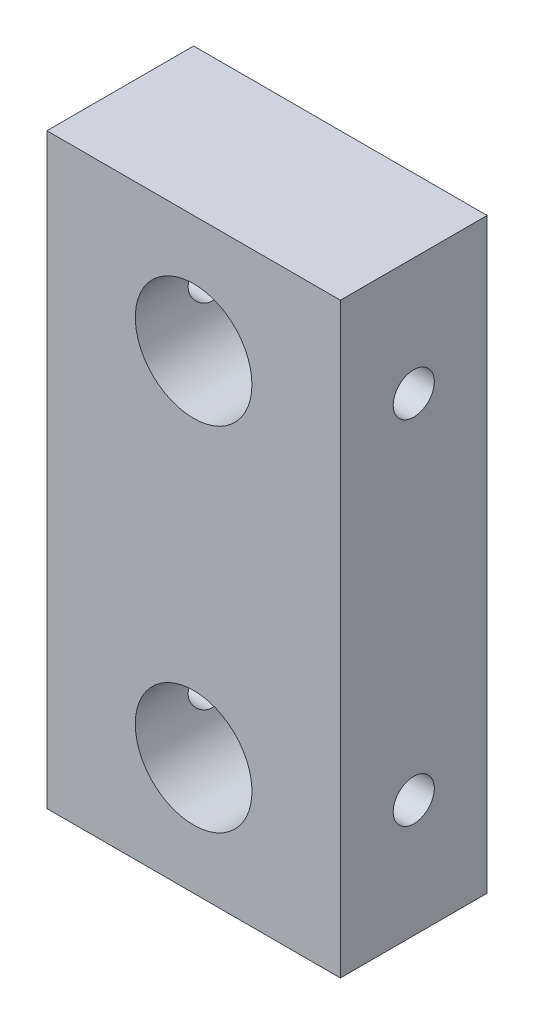
ISO-10303-21;
HEADER;
FILE_DESCRIPTION(('STEP AP214'),'2;1');
FILE_NAME('part.step','',(''),(''),'','','');
FILE_SCHEMA(('AUTOMOTIVE_DESIGN { 1 0 10303 214 1 1 1 1 }'));
ENDSEC;
DATA;
#1=APPLICATION_CONTEXT('core data for automotive mechanical design processes');
#2=APPLICATION_PROTOCOL_DEFINITION('international standard','automotive_design',2000,#1);
#3=PRODUCT_CONTEXT('',#1,'mechanical');
#4=PRODUCT('Part','Part','',(#3));
#5=PRODUCT_RELATED_PRODUCT_CATEGORY('part','',(#4));
#6=PRODUCT_DEFINITION_FORMATION('','',#4);
#7=PRODUCT_DEFINITION_CONTEXT('part definition',#1,'design');
#8=PRODUCT_DEFINITION('design','',#6,#7);
#9=PRODUCT_DEFINITION_SHAPE('','',#8);
#10=(LENGTH_UNIT() NAMED_UNIT(*) SI_UNIT(.MILLI.,.METRE.));
#11=(NAMED_UNIT(*) PLANE_ANGLE_UNIT() SI_UNIT($,.RADIAN.));
#12=(NAMED_UNIT(*) SI_UNIT($,.STERADIAN.) SOLID_ANGLE_UNIT());
#13=UNCERTAINTY_MEASURE_WITH_UNIT(LENGTH_MEASURE(1.E-05),#10,'distance_accuracy_value','');
#14=(GEOMETRIC_REPRESENTATION_CONTEXT(3) GLOBAL_UNCERTAINTY_ASSIGNED_CONTEXT((#13)) GLOBAL_UNIT_ASSIGNED_CONTEXT((#10,
#11,#12)) REPRESENTATION_CONTEXT('',''));
#15=CARTESIAN_POINT('',(0.,0.,0.));
#16=DIRECTION('',(0.,0.,1.));
#17=DIRECTION('',(1.,0.,0.));
#18=AXIS2_PLACEMENT_3D('',#15,#16,#17);
#19=CARTESIAN_POINT('',(0.,0.,10.));
#20=DIRECTION('',(0.,0.,-1.));
#21=DIRECTION('',(-1.,0.,0.));
#22=AXIS2_PLACEMENT_3D('',#19,#20,#21);
#23=PLANE('',#22);
#24=CARTESIAN_POINT('',(0.,12.,10.));
#25=DIRECTION('',(0.,0.,1.));
#26=DIRECTION('',(1.,0.,0.));
#27=AXIS2_PLACEMENT_3D('',#24,#25,#26);
#28=CIRCLE('',#27,3.9740620657712);
#29=CARTESIAN_POINT('',(3.9740620657712,12.,10.));
#30=VERTEX_POINT('',#29);
#31=EDGE_CURVE('E118',#30,#30,#28,.T.);
#32=ORIENTED_EDGE('',*,*,#31,.F.);
#33=EDGE_LOOP('',(#32));
#34=FACE_BOUND('',#33,.T.);
#35=DIRECTION('',(0.,1.,0.));
#36=VECTOR('',#35,1.);
#37=CARTESIAN_POINT('',(10.,-20.,10.));
#38=LINE('',#37,#36);
#39=CARTESIAN_POINT('',(10.,-20.,10.));
#40=VERTEX_POINT('',#39);
#41=CARTESIAN_POINT('',(10.,20.,10.));
#42=VERTEX_POINT('',#41);
#43=EDGE_CURVE('E99',#40,#42,#38,.T.);
#44=ORIENTED_EDGE('',*,*,#43,.T.);
#45=DIRECTION('',(-1.,0.,0.));
#46=VECTOR('',#45,1.);
#47=CARTESIAN_POINT('',(-10.,20.,10.));
#48=LINE('',#47,#46);
#49=CARTESIAN_POINT('',(-10.,20.,10.));
#50=VERTEX_POINT('',#49);
#51=EDGE_CURVE('E94',#42,#50,#48,.T.);
#52=ORIENTED_EDGE('',*,*,#51,.T.);
#53=DIRECTION('',(0.,-1.,0.));
#54=VECTOR('',#53,1.);
#55=CARTESIAN_POINT('',(-10.,-20.,10.));
#56=LINE('',#55,#54);
#57=CARTESIAN_POINT('',(-10.,-20.,10.));
#58=VERTEX_POINT('',#57);
#59=EDGE_CURVE('E97',#50,#58,#56,.T.);
#60=ORIENTED_EDGE('',*,*,#59,.T.);
#61=DIRECTION('',(1.,0.,0.));
#62=VECTOR('',#61,1.);
#63=CARTESIAN_POINT('',(-10.,-20.,10.));
#64=LINE('',#63,#62);
#65=EDGE_CURVE('E63',#58,#40,#64,.T.);
#66=ORIENTED_EDGE('',*,*,#65,.T.);
#67=EDGE_LOOP('',(#44,#52,#60,#66));
#68=FACE_BOUND('',#67,.T.);
#69=CARTESIAN_POINT('',(0.,-12.,10.));
#70=DIRECTION('',(0.,0.,1.));
#71=DIRECTION('',(-1.,0.,0.));
#72=AXIS2_PLACEMENT_3D('',#69,#70,#71);
#73=CIRCLE('',#72,3.9740620657712);
#74=CARTESIAN_POINT('',(-3.9740620657712,-12.,10.));
#75=VERTEX_POINT('',#74);
#76=EDGE_CURVE('E175',#75,#75,#73,.T.);
#77=ORIENTED_EDGE('',*,*,#76,.F.);
#78=EDGE_LOOP('',(#77));
#79=FACE_BOUND('',#78,.T.);
#80=ADVANCED_FACE('F39',(#34,#68,#79),#23,.F.);
#81=CARTESIAN_POINT('',(0.,0.,0.));
#82=DIRECTION('',(0.,0.,-1.));
#83=DIRECTION('',(-1.,0.,0.));
#84=AXIS2_PLACEMENT_3D('',#81,#82,#83);
#85=PLANE('',#84);
#86=CARTESIAN_POINT('',(0.,12.,0.));
#87=DIRECTION('',(0.,0.,1.));
#88=DIRECTION('',(1.,0.,0.));
#89=AXIS2_PLACEMENT_3D('',#86,#87,#88);
#90=CIRCLE('',#89,3.9740620657712);
#91=CARTESIAN_POINT('',(3.9740620657712,12.,0.));
#92=VERTEX_POINT('',#91);
#93=EDGE_CURVE('E178',#92,#92,#90,.T.);
#94=ORIENTED_EDGE('',*,*,#93,.T.);
#95=EDGE_LOOP('',(#94));
#96=FACE_BOUND('',#95,.T.);
#97=DIRECTION('',(0.,1.,0.));
#98=VECTOR('',#97,1.);
#99=CARTESIAN_POINT('',(10.,-20.,0.));
#100=LINE('',#99,#98);
#101=CARTESIAN_POINT('',(10.,-20.,0.));
#102=VERTEX_POINT('',#101);
#103=CARTESIAN_POINT('',(10.,20.,0.));
#104=VERTEX_POINT('',#103);
#105=EDGE_CURVE('E115',#102,#104,#100,.T.);
#106=ORIENTED_EDGE('',*,*,#105,.F.);
#107=DIRECTION('',(1.,0.,0.));
#108=VECTOR('',#107,1.);
#109=CARTESIAN_POINT('',(-10.,-20.,0.));
#110=LINE('',#109,#108);
#111=CARTESIAN_POINT('',(-10.,-20.,0.));
#112=VERTEX_POINT('',#111);
#113=EDGE_CURVE('E86',#112,#102,#110,.T.);
#114=ORIENTED_EDGE('',*,*,#113,.F.);
#115=DIRECTION('',(0.,-1.,0.));
#116=VECTOR('',#115,1.);
#117=CARTESIAN_POINT('',(-10.,-20.,0.));
#118=LINE('',#117,#116);
#119=CARTESIAN_POINT('',(-10.,20.,0.));
#120=VERTEX_POINT('',#119);
#121=EDGE_CURVE('E80',#120,#112,#118,.T.);
#122=ORIENTED_EDGE('',*,*,#121,.F.);
#123=DIRECTION('',(-1.,0.,0.));
#124=VECTOR('',#123,1.);
#125=CARTESIAN_POINT('',(-10.,20.,0.));
#126=LINE('',#125,#124);
#127=EDGE_CURVE('E104',#104,#120,#126,.T.);
#128=ORIENTED_EDGE('',*,*,#127,.F.);
#129=EDGE_LOOP('',(#106,#114,#122,#128));
#130=FACE_BOUND('',#129,.T.);
#131=CARTESIAN_POINT('',(0.,-12.,0.));
#132=DIRECTION('',(0.,0.,1.));
#133=DIRECTION('',(-1.,0.,0.));
#134=AXIS2_PLACEMENT_3D('',#131,#132,#133);
#135=CIRCLE('',#134,3.9740620657712);
#136=CARTESIAN_POINT('',(-3.9740620657712,-12.,0.));
#137=VERTEX_POINT('',#136);
#138=EDGE_CURVE('E174',#137,#137,#135,.T.);
#139=ORIENTED_EDGE('',*,*,#138,.T.);
#140=EDGE_LOOP('',(#139));
#141=FACE_BOUND('',#140,.T.);
#142=ADVANCED_FACE('F200',(#96,#130,#141),#85,.T.);
#143=CARTESIAN_POINT('',(10.,-20.,10.));
#144=DIRECTION('',(-1.,0.,0.));
#145=DIRECTION('',(0.,0.,1.));
#146=AXIS2_PLACEMENT_3D('',#143,#144,#145);
#147=PLANE('',#146);
#148=CARTESIAN_POINT('',(10.,-12.,5.));
#149=DIRECTION('',(-1.,0.,0.));
#150=DIRECTION('',(0.,0.,1.));
#151=AXIS2_PLACEMENT_3D('',#148,#149,#150);
#152=CIRCLE('',#151,1.4);
#153=CARTESIAN_POINT('',(10.,-12.,6.4));
#154=VERTEX_POINT('',#153);
#155=EDGE_CURVE('E160',#154,#154,#152,.T.);
#156=ORIENTED_EDGE('',*,*,#155,.T.);
#157=EDGE_LOOP('',(#156));
#158=FACE_BOUND('',#157,.T.);
#159=CARTESIAN_POINT('',(10.,12.,5.));
#160=DIRECTION('',(-1.,0.,0.));
#161=DIRECTION('',(0.,0.,1.));
#162=AXIS2_PLACEMENT_3D('',#159,#160,#161);
#163=CIRCLE('',#162,1.4);
#164=CARTESIAN_POINT('',(10.,12.,6.4));
#165=VERTEX_POINT('',#164);
#166=EDGE_CURVE('E170',#165,#165,#163,.T.);
#167=ORIENTED_EDGE('',*,*,#166,.T.);
#168=EDGE_LOOP('',(#167));
#169=FACE_BOUND('',#168,.T.);
#170=ORIENTED_EDGE('',*,*,#105,.T.);
#171=DIRECTION('',(0.,0.,-1.));
#172=VECTOR('',#171,1.);
#173=CARTESIAN_POINT('',(10.,20.,10.));
#174=LINE('',#173,#172);
#175=EDGE_CURVE('E11',#42,#104,#174,.T.);
#176=ORIENTED_EDGE('',*,*,#175,.F.);
#177=ORIENTED_EDGE('',*,*,#43,.F.);
#178=DIRECTION('',(0.,0.,-1.));
#179=VECTOR('',#178,1.);
#180=CARTESIAN_POINT('',(10.,-20.,10.));
#181=LINE('',#180,#179);
#182=EDGE_CURVE('E111',#40,#102,#181,.T.);
#183=ORIENTED_EDGE('',*,*,#182,.T.);
#184=EDGE_LOOP('',(#170,#176,#177,#183));
#185=FACE_BOUND('',#184,.T.);
#186=ADVANCED_FACE('F41',(#158,#169,#185),#147,.F.);
#187=CARTESIAN_POINT('',(-10.,20.,10.));
#188=DIRECTION('',(0.,-1.,0.));
#189=DIRECTION('',(0.,0.,-1.));
#190=AXIS2_PLACEMENT_3D('',#187,#188,#189);
#191=PLANE('',#190);
#192=ORIENTED_EDGE('',*,*,#127,.T.);
#193=DIRECTION('',(0.,0.,-1.));
#194=VECTOR('',#193,1.);
#195=CARTESIAN_POINT('',(-10.,20.,10.));
#196=LINE('',#195,#194);
#197=EDGE_CURVE('E54',#50,#120,#196,.T.);
#198=ORIENTED_EDGE('',*,*,#197,.F.);
#199=ORIENTED_EDGE('',*,*,#51,.F.);
#200=ORIENTED_EDGE('',*,*,#175,.T.);
#201=EDGE_LOOP('',(#192,#198,#199,#200));
#202=FACE_BOUND('',#201,.T.);
#203=ADVANCED_FACE('F103',(#202),#191,.F.);
#204=CARTESIAN_POINT('',(-10.,-20.,10.));
#205=DIRECTION('',(1.,0.,0.));
#206=DIRECTION('',(0.,0.,-1.));
#207=AXIS2_PLACEMENT_3D('',#204,#205,#206);
#208=PLANE('',#207);
#209=CARTESIAN_POINT('',(-10.,-12.,5.));
#210=DIRECTION('',(-1.,0.,0.));
#211=DIRECTION('',(0.,0.,-1.));
#212=AXIS2_PLACEMENT_3D('',#209,#210,#211);
#213=CIRCLE('',#212,1.4);
#214=CARTESIAN_POINT('',(-10.,-12.,3.6));
#215=VERTEX_POINT('',#214);
#216=EDGE_CURVE('E156',#215,#215,#213,.T.);
#217=ORIENTED_EDGE('',*,*,#216,.F.);
#218=EDGE_LOOP('',(#217));
#219=FACE_BOUND('',#218,.T.);
#220=CARTESIAN_POINT('',(-10.,12.,5.));
#221=DIRECTION('',(-1.,0.,0.));
#222=DIRECTION('',(0.,0.,1.));
#223=AXIS2_PLACEMENT_3D('',#220,#221,#222);
#224=CIRCLE('',#223,1.4);
#225=CARTESIAN_POINT('',(-10.,12.,6.4));
#226=VERTEX_POINT('',#225);
#227=EDGE_CURVE('E133',#226,#226,#224,.T.);
#228=ORIENTED_EDGE('',*,*,#227,.F.);
#229=EDGE_LOOP('',(#228));
#230=FACE_BOUND('',#229,.T.);
#231=ORIENTED_EDGE('',*,*,#121,.T.);
#232=DIRECTION('',(0.,0.,-1.));
#233=VECTOR('',#232,1.);
#234=CARTESIAN_POINT('',(-10.,-20.,10.));
#235=LINE('',#234,#233);
#236=EDGE_CURVE('E105',#58,#112,#235,.T.);
#237=ORIENTED_EDGE('',*,*,#236,.F.);
#238=ORIENTED_EDGE('',*,*,#59,.F.);
#239=ORIENTED_EDGE('',*,*,#197,.T.);
#240=EDGE_LOOP('',(#231,#237,#238,#239));
#241=FACE_BOUND('',#240,.T.);
#242=ADVANCED_FACE('F107',(#219,#230,#241),#208,.F.);
#243=CARTESIAN_POINT('',(-10.,-20.,10.));
#244=DIRECTION('',(0.,1.,0.));
#245=DIRECTION('',(0.,0.,1.));
#246=AXIS2_PLACEMENT_3D('',#243,#244,#245);
#247=PLANE('',#246);
#248=ORIENTED_EDGE('',*,*,#113,.T.);
#249=ORIENTED_EDGE('',*,*,#182,.F.);
#250=ORIENTED_EDGE('',*,*,#65,.F.);
#251=ORIENTED_EDGE('',*,*,#236,.T.);
#252=EDGE_LOOP('',(#248,#249,#250,#251));
#253=FACE_BOUND('',#252,.T.);
#254=ADVANCED_FACE('F193',(#253),#247,.F.);
#255=CARTESIAN_POINT('',(0.,12.,10.));
#256=DIRECTION('',(0.,0.,-1.));
#257=DIRECTION('',(-1.,0.,0.));
#258=AXIS2_PLACEMENT_3D('',#255,#256,#257);
#259=CYLINDRICAL_SURFACE('',#258,3.9740620657712);
#260=CARTESIAN_POINT('',(-3.9740620657712,12.,6.4));
#261=CARTESIAN_POINT('',(-3.97406299076738,11.9238632491379,6.40000130716296));
#262=CARTESIAN_POINT('',(-3.97185438830035,11.8477358329171,6.39376924705612));
#263=CARTESIAN_POINT('',(-3.96326270757502,11.6977381661153,6.36909269565642));
#264=CARTESIAN_POINT('',(-3.95687966762892,11.623867894825,6.35064831644591));
#265=CARTESIAN_POINT('',(-3.94062900826498,11.4805686406407,6.30226820866657));
#266=CARTESIAN_POINT('',(-3.93076761874704,11.4111319778167,6.2723530166146));
#267=CARTESIAN_POINT('',(-3.90855591190384,11.2782636594435,6.20197844984834));
#268=CARTESIAN_POINT('',(-3.89620501908492,11.2148333973745,6.16151663645677));
#269=CARTESIAN_POINT('',(-3.86977643276472,11.0933587111181,6.06958011130808));
#270=CARTESIAN_POINT('',(-3.85565396136527,11.0355745261973,6.0177745164163));
#271=CARTESIAN_POINT('',(-3.82750844305423,10.9293105677396,5.90532384825463));
#272=CARTESIAN_POINT('',(-3.81348542249417,10.8808331775851,5.84467651767703));
#273=CARTESIAN_POINT('',(-3.78662159123778,10.7929997726817,5.71383339041184));
#274=CARTESIAN_POINT('',(-3.77383461196846,10.7539949081323,5.64338973456764));
#275=CARTESIAN_POINT('',(-3.7515785202712,10.6884995880792,5.4964197240619));
#276=CARTESIAN_POINT('',(-3.74210825916802,10.6620047988662,5.41989548656862));
#277=CARTESIAN_POINT('',(-3.72803250905807,10.6232807808123,5.26591400100132));
#278=CARTESIAN_POINT('',(-3.72325987542372,10.6105596641277,5.18859621481946));
#279=CARTESIAN_POINT('',(-3.71862751810703,10.5982059800021,5.03278755582192));
#280=CARTESIAN_POINT('',(-3.71876605980011,10.5985687913253,4.95429710698089));
#281=CARTESIAN_POINT('',(-3.72379495829744,10.6119933491273,4.80269605304949));
#282=CARTESIAN_POINT('',(-3.72843869096135,10.624396027642,4.72951744337721));
#283=CARTESIAN_POINT('',(-3.74154839545872,10.6604667470507,4.58635548635687));
#284=CARTESIAN_POINT('',(-3.75001487568174,10.6841362863542,4.51637256536899));
#285=CARTESIAN_POINT('',(-3.76997955550244,10.7424688637118,4.38015987668814));
#286=CARTESIAN_POINT('',(-3.78152800762979,10.7773162599723,4.31401674647287));
#287=CARTESIAN_POINT('',(-3.80633626031707,10.8568872442185,4.18831608666073));
#288=CARTESIAN_POINT('',(-3.8195965993597,10.9016139429496,4.12876064024503));
#289=CARTESIAN_POINT('',(-3.84728615581248,11.0027729406603,4.01424595989544));
#290=CARTESIAN_POINT('',(-3.86173827411973,11.0597385967818,3.95976236693862));
#291=CARTESIAN_POINT('',(-3.88950670301774,11.1821719533584,3.86098971545828));
#292=CARTESIAN_POINT('',(-3.90282287755698,11.2476406698596,3.81670187700009));
#293=CARTESIAN_POINT('',(-3.92703119997744,11.3863202051055,3.73913406125834));
#294=CARTESIAN_POINT('',(-3.93789175962928,11.4596158071633,3.70599511734707));
#295=CARTESIAN_POINT('',(-3.95573392315394,11.6112174687782,3.65267014361962));
#296=CARTESIAN_POINT('',(-3.96271703916817,11.6895215617986,3.63247906386566));
#297=CARTESIAN_POINT('',(-3.97176021260367,11.8449011192699,3.60649712577821));
#298=CARTESIAN_POINT('',(-3.97403946552562,11.9218566517211,3.60006457249826));
#299=CARTESIAN_POINT('',(-3.97408431217555,12.0757713903858,3.59993643200145));
#300=CARTESIAN_POINT('',(-3.97185077037708,12.1527305930722,3.6062384053514));
#301=CARTESIAN_POINT('',(-3.96326586836605,12.301809759651,3.63090088984939));
#302=CARTESIAN_POINT('',(-3.957053076077,12.3740055956574,3.64885588228213));
#303=CARTESIAN_POINT('',(-3.94127278584392,12.5143219289863,3.69579589016714));
#304=CARTESIAN_POINT('',(-3.93170485328062,12.5824418969887,3.72478233465678));
#305=CARTESIAN_POINT('',(-3.90984246767208,12.7147922449234,3.79384952566672));
#306=CARTESIAN_POINT('',(-3.89747950386399,12.7788614705039,3.83421675848886));
#307=CARTESIAN_POINT('',(-3.87141474690015,12.8995185029472,3.92456913588847));
#308=CARTESIAN_POINT('',(-3.85771250520531,12.9561037883217,3.97455750816244));
#309=CARTESIAN_POINT('',(-3.8296215744806,13.063198035798,4.08574284438808));
#310=CARTESIAN_POINT('',(-3.81523352842231,13.1132497229725,4.14738153199234));
#311=CARTESIAN_POINT('',(-3.78809334900328,13.2023706271703,4.27848302467864));
#312=CARTESIAN_POINT('',(-3.77534127998417,13.2414394123169,4.34794613728726));
#313=CARTESIAN_POINT('',(-3.75301572830405,13.3073873709782,4.49296714148634));
#314=CARTESIAN_POINT('',(-3.74344333915057,13.3342623521441,4.56852711873791));
#315=CARTESIAN_POINT('',(-3.72876316632749,13.3747609294465,4.72352311796735));
#316=CARTESIAN_POINT('',(-3.72365305152176,13.3883914450426,4.80295709320179));
#317=CARTESIAN_POINT('',(-3.71876132237575,13.4014375654857,4.95855834621949));
#318=CARTESIAN_POINT('',(-3.71869183082166,13.4016211500576,5.03465282115501));
#319=CARTESIAN_POINT('',(-3.72316574992853,13.389692690837,5.18572649227421));
#320=CARTESIAN_POINT('',(-3.72770882059773,13.377581553288,5.26070577024569));
#321=CARTESIAN_POINT('',(-3.74066994504375,13.3419765664647,5.4056324749777));
#322=CARTESIAN_POINT('',(-3.74899347105649,13.318759696096,5.47565709158563));
#323=CARTESIAN_POINT('',(-3.76853340213479,13.2618346002039,5.61086629950798));
#324=CARTESIAN_POINT('',(-3.77975049284722,13.2281238877118,5.67604973895626));
#325=CARTESIAN_POINT('',(-3.80448019602381,13.1492959944011,5.80310097774087));
#326=CARTESIAN_POINT('',(-3.81807678547265,13.1037114084334,5.86466228856341));
#327=CARTESIAN_POINT('',(-3.84571105275315,13.0031899132098,5.97950875085334));
#328=CARTESIAN_POINT('',(-3.85974886111676,12.9482502146555,6.03279142489387));
#329=CARTESIAN_POINT('',(-3.88744983588713,12.8275866260141,6.13202156436028));
#330=CARTESIAN_POINT('',(-3.90106700324151,12.7614861759869,6.17752577289977));
#331=CARTESIAN_POINT('',(-3.92570352574442,12.6221106941998,6.25674202286226));
#332=CARTESIAN_POINT('',(-3.93672317842965,12.5488364855326,6.29045541509847));
#333=CARTESIAN_POINT('',(-3.95485017508797,12.3976028977471,6.34473959970089));
#334=CARTESIAN_POINT('',(-3.96198087224606,12.3196746743459,6.36538896419913));
#335=CARTESIAN_POINT('',(-3.97158548072441,12.1611601635844,6.39301598477926));
#336=CARTESIAN_POINT('',(-3.97406108685586,12.080574854485,6.39999861664092));
#337=CARTESIAN_POINT('',(-3.9740620657712,12.,6.4));
#338=B_SPLINE_CURVE_WITH_KNOTS('',3,(#260,#261,#262,#263,#264,#265,#266,#267,#268,#269,#270,
#271,#272,#273,#274,#275,#276,#277,#278,#279,#280,#281,#282,#283,#284,#285,#286,#287,#288,#289,
#290,#291,#292,#293,#294,#295,#296,#297,#298,#299,#300,#301,#302,#303,#304,#305,#306,#307,#308,
#309,#310,#311,#312,#313,#314,#315,#316,#317,#318,#319,#320,#321,#322,#323,#324,#325,#326,#327,
#328,#329,#330,#331,#332,#333,#334,#335,#336,#337),.UNSPECIFIED.,.T.,.F.,(4,2,2,2,2,2,2,2,2,2,2,
2,2,2,2,2,2,2,2,2,2,2,2,2,2,2,2,2,2,2,2,2,2,2,2,2,2,2,4),(0.,0.228113425178087,
0.456224756803591,0.683929586896564,0.911687115568946,1.14727729809536,1.38292773280091,
1.62630396091785,1.86959581727646,2.10387928111179,2.33807999697389,2.5601437903135,
2.78223712475768,3.00820007054267,3.23423426809542,3.47354903039417,3.71289241519983,
3.95515867321822,4.19733038476894,4.42793604179114,4.65849752804989,4.88143710200168,
5.10440556584771,5.33358352568652,5.56283850450462,5.80378943643102,6.04474984185729,
6.28579302916251,6.52671021766525,6.75385677113896,6.9809865828658,7.202725707259,
7.42451742236152,7.65688909666168,7.88933017606088,8.13233199006419,8.37530595547244,
8.61680433010967,8.85821476372663),.UNSPECIFIED.);
#339=CARTESIAN_POINT('',(-3.9740620657712,12.,6.4));
#340=VERTEX_POINT('',#339);
#341=EDGE_CURVE('E132',#340,#340,#338,.T.);
#342=ORIENTED_EDGE('',*,*,#341,.F.);
#343=EDGE_LOOP('',(#342));
#344=FACE_BOUND('',#343,.T.);
#345=CARTESIAN_POINT('',(3.9740620657712,12.,6.4));
#346=CARTESIAN_POINT('',(3.97406299076738,12.0761367508621,6.40000130716296));
#347=CARTESIAN_POINT('',(3.97185438830035,12.1522641670829,6.39376924705612));
#348=CARTESIAN_POINT('',(3.96326270757502,12.3022618338847,6.36909269565642));
#349=CARTESIAN_POINT('',(3.95687966762892,12.376132105175,6.35064831644591));
#350=CARTESIAN_POINT('',(3.94062900826498,12.5194313593593,6.30226820866657));
#351=CARTESIAN_POINT('',(3.93076761874704,12.5888680221833,6.2723530166146));
#352=CARTESIAN_POINT('',(3.90855591190384,12.7217363405565,6.20197844984834));
#353=CARTESIAN_POINT('',(3.89620501908492,12.7851666026255,6.16151663645677));
#354=CARTESIAN_POINT('',(3.86977643276472,12.9066412888819,6.06958011130809));
#355=CARTESIAN_POINT('',(3.85565396136527,12.9644254738027,6.0177745164163));
#356=CARTESIAN_POINT('',(3.82750844305423,13.0706894322604,5.90532384825463));
#357=CARTESIAN_POINT('',(3.81348542249417,13.1191668224149,5.84467651767704));
#358=CARTESIAN_POINT('',(3.78662159123778,13.2070002273183,5.71383339041185));
#359=CARTESIAN_POINT('',(3.77383461196846,13.2460050918677,5.64338973456764));
#360=CARTESIAN_POINT('',(3.7515785202712,13.3115004119208,5.4964197240619));
#361=CARTESIAN_POINT('',(3.74210825916802,13.3379952011338,5.41989548656863));
#362=CARTESIAN_POINT('',(3.72803250905807,13.3767192191877,5.26591400100133));
#363=CARTESIAN_POINT('',(3.72325987542372,13.3894403358723,5.18859621481947));
#364=CARTESIAN_POINT('',(3.71862751810703,13.4017940199979,5.03278755582192));
#365=CARTESIAN_POINT('',(3.71876605980011,13.4014312086748,4.95429710698089));
#366=CARTESIAN_POINT('',(3.72379495829744,13.3880066508727,4.80269605304949));
#367=CARTESIAN_POINT('',(3.72843869096135,13.375603972358,4.72951744337721));
#368=CARTESIAN_POINT('',(3.74154839545872,13.3395332529493,4.58635548635688));
#369=CARTESIAN_POINT('',(3.75001487568174,13.3158637136458,4.516372565369));
#370=CARTESIAN_POINT('',(3.76997955550244,13.2575311362882,4.38015987668814));
#371=CARTESIAN_POINT('',(3.78152800762979,13.2226837400277,4.31401674647287));
#372=CARTESIAN_POINT('',(3.80633626031707,13.1431127557815,4.18831608666073));
#373=CARTESIAN_POINT('',(3.8195965993597,13.0983860570504,4.12876064024503));
#374=CARTESIAN_POINT('',(3.84728615581248,12.9972270593397,4.01424595989544));
#375=CARTESIAN_POINT('',(3.86173827411973,12.9402614032182,3.95976236693862));
#376=CARTESIAN_POINT('',(3.88950670301774,12.8178280466416,3.86098971545828));
#377=CARTESIAN_POINT('',(3.90282287755698,12.7523593301405,3.81670187700009));
#378=CARTESIAN_POINT('',(3.92703119997744,12.6136797948945,3.73913406125834));
#379=CARTESIAN_POINT('',(3.93789175962928,12.5403841928367,3.70599511734707));
#380=CARTESIAN_POINT('',(3.95573392315394,12.3887825312218,3.65267014361962));
#381=CARTESIAN_POINT('',(3.96271703916817,12.3104784382014,3.63247906386566));
#382=CARTESIAN_POINT('',(3.97176021260368,12.1550988807301,3.60649712577821));
#383=CARTESIAN_POINT('',(3.97403946552562,12.0781433482789,3.60006457249826));
#384=CARTESIAN_POINT('',(3.97408431217555,11.9242286096142,3.59993643200145));
#385=CARTESIAN_POINT('',(3.97185077037708,11.8472694069278,3.6062384053514));
#386=CARTESIAN_POINT('',(3.96326586836605,11.698190240349,3.63090088984938));
#387=CARTESIAN_POINT('',(3.957053076077,11.6259944043426,3.64885588228212));
#388=CARTESIAN_POINT('',(3.94127278584392,11.4856780710137,3.69579589016714));
#389=CARTESIAN_POINT('',(3.93170485328062,11.4175581030113,3.72478233465678));
#390=CARTESIAN_POINT('',(3.90984246767208,11.2852077550766,3.79384952566672));
#391=CARTESIAN_POINT('',(3.89747950386399,11.2211385294961,3.83421675848886));
#392=CARTESIAN_POINT('',(3.87141474690015,11.1004814970528,3.92456913588846));
#393=CARTESIAN_POINT('',(3.85771250520531,11.0438962116783,3.97455750816244));
#394=CARTESIAN_POINT('',(3.82962157448061,10.936801964202,4.08574284438808));
#395=CARTESIAN_POINT('',(3.81523352842231,10.8867502770275,4.14738153199234));
#396=CARTESIAN_POINT('',(3.78809334900328,10.7976293728297,4.27848302467864));
#397=CARTESIAN_POINT('',(3.77534127998417,10.7585605876831,4.34794613728726));
#398=CARTESIAN_POINT('',(3.75301572830406,10.6926126290218,4.49296714148634));
#399=CARTESIAN_POINT('',(3.74344333915057,10.6657376478559,4.5685271187379));
#400=CARTESIAN_POINT('',(3.72876316632749,10.6252390705535,4.72352311796735));
#401=CARTESIAN_POINT('',(3.72365305152176,10.6116085549574,4.80295709320179));
#402=CARTESIAN_POINT('',(3.71876132237576,10.5985624345143,4.95855834621949));
#403=CARTESIAN_POINT('',(3.71869183082167,10.5983788499424,5.03465282115501));
#404=CARTESIAN_POINT('',(3.72316574992854,10.610307309163,5.1857264922742));
#405=CARTESIAN_POINT('',(3.72770882059774,10.622418446712,5.26070577024569));
#406=CARTESIAN_POINT('',(3.74066994504375,10.6580234335353,5.4056324749777));
#407=CARTESIAN_POINT('',(3.7489934710565,10.681240303904,5.47565709158562));
#408=CARTESIAN_POINT('',(3.76853340213479,10.7381653997961,5.61086629950797));
#409=CARTESIAN_POINT('',(3.77975049284723,10.7718761122882,5.67604973895626));
#410=CARTESIAN_POINT('',(3.80448019602381,10.8507040055989,5.80310097774087));
#411=CARTESIAN_POINT('',(3.81807678547265,10.8962885915666,5.86466228856341));
#412=CARTESIAN_POINT('',(3.84571105275315,10.9968100867902,5.97950875085334));
#413=CARTESIAN_POINT('',(3.85974886111676,11.0517497853445,6.03279142489387));
#414=CARTESIAN_POINT('',(3.88744983588713,11.1724133739859,6.13202156436028));
#415=CARTESIAN_POINT('',(3.90106700324151,11.2385138240131,6.17752577289977));
#416=CARTESIAN_POINT('',(3.92570352574442,11.3778893058002,6.25674202286226));
#417=CARTESIAN_POINT('',(3.93672317842965,11.4511635144674,6.29045541509846));
#418=CARTESIAN_POINT('',(3.95485017508797,11.6023971022529,6.34473959970089));
#419=CARTESIAN_POINT('',(3.96198087224606,11.6803253256541,6.36538896419913));
#420=CARTESIAN_POINT('',(3.97158548072441,11.8388398364156,6.39301598477926));
#421=CARTESIAN_POINT('',(3.97406108685586,11.919425145515,6.39999861664092));
#422=CARTESIAN_POINT('',(3.9740620657712,12.,6.4));
#423=B_SPLINE_CURVE_WITH_KNOTS('',3,(#345,#346,#347,#348,#349,#350,#351,#352,#353,#354,#355,
#356,#357,#358,#359,#360,#361,#362,#363,#364,#365,#366,#367,#368,#369,#370,#371,#372,#373,#374,
#375,#376,#377,#378,#379,#380,#381,#382,#383,#384,#385,#386,#387,#388,#389,#390,#391,#392,#393,
#394,#395,#396,#397,#398,#399,#400,#401,#402,#403,#404,#405,#406,#407,#408,#409,#410,#411,#412,
#413,#414,#415,#416,#417,#418,#419,#420,#421,#422),.UNSPECIFIED.,.T.,.F.,(4,2,2,2,2,2,2,2,2,2,2,
2,2,2,2,2,2,2,2,2,2,2,2,2,2,2,2,2,2,2,2,2,2,2,2,2,2,2,4),(0.,0.228113425178085,0.45622475680359,
0.683929586896563,0.911687115568946,1.14727729809536,1.38292773280091,1.62630396091784,
1.86959581727646,2.10387928111179,2.33807999697389,2.56014379031349,2.78223712475768,
3.00820007054267,3.23423426809541,3.47354903039417,3.71289241519983,3.95515867321822,
4.19733038476893,4.42793604179114,4.65849752804989,4.88143710200167,5.1044055658477,
5.33358352568652,5.56283850450462,5.80378943643102,6.04474984185729,6.28579302916251,
6.52671021766525,6.75385677113896,6.9809865828658,7.202725707259,7.42451742236152,
7.65688909666168,7.88933017606088,8.13233199006419,8.37530595547244,8.61680433010967,
8.85821476372663),.UNSPECIFIED.);
#424=CARTESIAN_POINT('',(3.9740620657712,12.,6.4));
#425=VERTEX_POINT('',#424);
#426=EDGE_CURVE('E124',#425,#425,#423,.T.);
#427=ORIENTED_EDGE('',*,*,#426,.F.);
#428=EDGE_LOOP('',(#427));
#429=FACE_BOUND('',#428,.T.);
#430=ORIENTED_EDGE('',*,*,#31,.T.);
#431=EDGE_LOOP('',(#430));
#432=FACE_BOUND('',#431,.T.);
#433=ORIENTED_EDGE('',*,*,#93,.F.);
#434=EDGE_LOOP('',(#433));
#435=FACE_BOUND('',#434,.T.);
#436=ADVANCED_FACE('F136',(#344,#429,#432,#435),#259,.F.);
#437=CARTESIAN_POINT('',(0.,-12.,10.));
#438=DIRECTION('',(0.,0.,-1.));
#439=DIRECTION('',(-1.,0.,0.));
#440=AXIS2_PLACEMENT_3D('',#437,#438,#439);
#441=CYLINDRICAL_SURFACE('',#440,3.9740620657712);
#442=CARTESIAN_POINT('',(-3.9740620657712,-12.,6.4));
#443=CARTESIAN_POINT('',(-3.97406299076738,-12.0761367508621,6.40000130716296));
#444=CARTESIAN_POINT('',(-3.97185438830035,-12.1522641670829,6.39376924705612));
#445=CARTESIAN_POINT('',(-3.96326270757502,-12.3022618338847,6.36909269565642));
#446=CARTESIAN_POINT('',(-3.95687966762892,-12.376132105175,6.35064831644591));
#447=CARTESIAN_POINT('',(-3.94062900826498,-12.5194313593593,6.30226820866657));
#448=CARTESIAN_POINT('',(-3.93076761874704,-12.5888680221833,6.2723530166146));
#449=CARTESIAN_POINT('',(-3.90855591190384,-12.7217363405565,6.20197844984834));
#450=CARTESIAN_POINT('',(-3.89620501908492,-12.7851666026255,6.16151663645677));
#451=CARTESIAN_POINT('',(-3.86977643276472,-12.9066412888819,6.06958011130809));
#452=CARTESIAN_POINT('',(-3.85565396136527,-12.9644254738027,6.0177745164163));
#453=CARTESIAN_POINT('',(-3.82750844305423,-13.0706894322604,5.90532384825463));
#454=CARTESIAN_POINT('',(-3.81348542249417,-13.1191668224149,5.84467651767704));
#455=CARTESIAN_POINT('',(-3.78662159123778,-13.2070002273183,5.71383339041185));
#456=CARTESIAN_POINT('',(-3.77383461196846,-13.2460050918677,5.64338973456764));
#457=CARTESIAN_POINT('',(-3.7515785202712,-13.3115004119208,5.4964197240619));
#458=CARTESIAN_POINT('',(-3.74210825916802,-13.3379952011338,5.41989548656863));
#459=CARTESIAN_POINT('',(-3.72803250905807,-13.3767192191877,5.26591400100133));
#460=CARTESIAN_POINT('',(-3.72325987542372,-13.3894403358723,5.18859621481947));
#461=CARTESIAN_POINT('',(-3.71862751810703,-13.4017940199979,5.03278755582192));
#462=CARTESIAN_POINT('',(-3.71876605980011,-13.4014312086748,4.95429710698089));
#463=CARTESIAN_POINT('',(-3.72379495829744,-13.3880066508727,4.80269605304949));
#464=CARTESIAN_POINT('',(-3.72843869096135,-13.375603972358,4.72951744337721));
#465=CARTESIAN_POINT('',(-3.74154839545872,-13.3395332529493,4.58635548635688));
#466=CARTESIAN_POINT('',(-3.75001487568174,-13.3158637136458,4.516372565369));
#467=CARTESIAN_POINT('',(-3.76997955550244,-13.2575311362882,4.38015987668814));
#468=CARTESIAN_POINT('',(-3.78152800762979,-13.2226837400277,4.31401674647287));
#469=CARTESIAN_POINT('',(-3.80633626031707,-13.1431127557815,4.18831608666073));
#470=CARTESIAN_POINT('',(-3.8195965993597,-13.0983860570504,4.12876064024503));
#471=CARTESIAN_POINT('',(-3.84728615581248,-12.9972270593397,4.01424595989544));
#472=CARTESIAN_POINT('',(-3.86173827411973,-12.9402614032182,3.95976236693862));
#473=CARTESIAN_POINT('',(-3.88950670301774,-12.8178280466416,3.86098971545828));
#474=CARTESIAN_POINT('',(-3.90282287755698,-12.7523593301405,3.81670187700009));
#475=CARTESIAN_POINT('',(-3.92703119997744,-12.6136797948945,3.73913406125834));
#476=CARTESIAN_POINT('',(-3.93789175962928,-12.5403841928367,3.70599511734707));
#477=CARTESIAN_POINT('',(-3.95573392315394,-12.3887825312218,3.65267014361962));
#478=CARTESIAN_POINT('',(-3.96271703916817,-12.3104784382014,3.63247906386566));
#479=CARTESIAN_POINT('',(-3.97176021260367,-12.1550988807301,3.60649712577821));
#480=CARTESIAN_POINT('',(-3.97403946552562,-12.0781433482789,3.60006457249826));
#481=CARTESIAN_POINT('',(-3.97408431217555,-11.9242286096142,3.59993643200145));
#482=CARTESIAN_POINT('',(-3.97185077037708,-11.8472694069278,3.6062384053514));
#483=CARTESIAN_POINT('',(-3.96326586836605,-11.698190240349,3.63090088984938));
#484=CARTESIAN_POINT('',(-3.957053076077,-11.6259944043426,3.64885588228212));
#485=CARTESIAN_POINT('',(-3.94127278584392,-11.4856780710137,3.69579589016714));
#486=CARTESIAN_POINT('',(-3.93170485328062,-11.4175581030113,3.72478233465677));
#487=CARTESIAN_POINT('',(-3.90984246767208,-11.2852077550766,3.79384952566672));
#488=CARTESIAN_POINT('',(-3.89747950386399,-11.2211385294961,3.83421675848886));
#489=CARTESIAN_POINT('',(-3.87141474690015,-11.1004814970528,3.92456913588846));
#490=CARTESIAN_POINT('',(-3.85771250520531,-11.0438962116783,3.97455750816244));
#491=CARTESIAN_POINT('',(-3.8296215744806,-10.936801964202,4.08574284438808));
#492=CARTESIAN_POINT('',(-3.81523352842231,-10.8867502770275,4.14738153199234));
#493=CARTESIAN_POINT('',(-3.78809334900328,-10.7976293728297,4.27848302467864));
#494=CARTESIAN_POINT('',(-3.77534127998417,-10.7585605876831,4.34794613728726));
#495=CARTESIAN_POINT('',(-3.75301572830405,-10.6926126290218,4.49296714148634));
#496=CARTESIAN_POINT('',(-3.74344333915057,-10.6657376478559,4.5685271187379));
#497=CARTESIAN_POINT('',(-3.72876316632749,-10.6252390705535,4.72352311796734));
#498=CARTESIAN_POINT('',(-3.72365305152176,-10.6116085549574,4.80295709320179));
#499=CARTESIAN_POINT('',(-3.71876132237576,-10.5985624345143,4.95855834621949));
#500=CARTESIAN_POINT('',(-3.71869183082167,-10.5983788499424,5.03465282115501));
#501=CARTESIAN_POINT('',(-3.72316574992853,-10.610307309163,5.1857264922742));
#502=CARTESIAN_POINT('',(-3.72770882059773,-10.622418446712,5.26070577024568));
#503=CARTESIAN_POINT('',(-3.74066994504375,-10.6580234335353,5.4056324749777));
#504=CARTESIAN_POINT('',(-3.7489934710565,-10.681240303904,5.47565709158562));
#505=CARTESIAN_POINT('',(-3.76853340213479,-10.7381653997961,5.61086629950797));
#506=CARTESIAN_POINT('',(-3.77975049284722,-10.7718761122882,5.67604973895626));
#507=CARTESIAN_POINT('',(-3.80448019602381,-10.8507040055989,5.80310097774087));
#508=CARTESIAN_POINT('',(-3.81807678547265,-10.8962885915666,5.8646622885634));
#509=CARTESIAN_POINT('',(-3.84571105275315,-10.9968100867902,5.97950875085333));
#510=CARTESIAN_POINT('',(-3.85974886111676,-11.0517497853445,6.03279142489387));
#511=CARTESIAN_POINT('',(-3.88744983588713,-11.1724133739859,6.13202156436028));
#512=CARTESIAN_POINT('',(-3.90106700324151,-11.2385138240131,6.17752577289977));
#513=CARTESIAN_POINT('',(-3.92570352574442,-11.3778893058002,6.25674202286226));
#514=CARTESIAN_POINT('',(-3.93672317842965,-11.4511635144674,6.29045541509846));
#515=CARTESIAN_POINT('',(-3.95485017508797,-11.6023971022529,6.34473959970089));
#516=CARTESIAN_POINT('',(-3.96198087224606,-11.6803253256541,6.36538896419912));
#517=CARTESIAN_POINT('',(-3.97158548072441,-11.8388398364156,6.39301598477926));
#518=CARTESIAN_POINT('',(-3.97406108685586,-11.919425145515,6.39999861664092));
#519=CARTESIAN_POINT('',(-3.9740620657712,-12.,6.4));
#520=B_SPLINE_CURVE_WITH_KNOTS('',3,(#442,#443,#444,#445,#446,#447,#448,#449,#450,#451,#452,
#453,#454,#455,#456,#457,#458,#459,#460,#461,#462,#463,#464,#465,#466,#467,#468,#469,#470,#471,
#472,#473,#474,#475,#476,#477,#478,#479,#480,#481,#482,#483,#484,#485,#486,#487,#488,#489,#490,
#491,#492,#493,#494,#495,#496,#497,#498,#499,#500,#501,#502,#503,#504,#505,#506,#507,#508,#509,
#510,#511,#512,#513,#514,#515,#516,#517,#518,#519),.UNSPECIFIED.,.T.,.F.,(4,2,2,2,2,2,2,2,2,2,2,
2,2,2,2,2,2,2,2,2,2,2,2,2,2,2,2,2,2,2,2,2,2,2,2,2,2,2,4),(0.,0.228113425178087,0.45622475680359,
0.683929586896565,0.911687115568948,1.14727729809536,1.38292773280091,1.62630396091784,
1.86959581727646,2.10387928111179,2.33807999697389,2.5601437903135,2.78223712475768,
3.00820007054267,3.23423426809541,3.47354903039417,3.71289241519983,3.95515867321822,
4.19733038476893,4.42793604179114,4.65849752804989,4.88143710200167,5.1044055658477,
5.33358352568652,5.56283850450462,5.80378943643102,6.04474984185729,6.28579302916251,
6.52671021766525,6.75385677113895,6.9809865828658,7.202725707259,7.42451742236152,
7.65688909666167,7.88933017606088,8.13233199006419,8.37530595547244,8.61680433010967,
8.85821476372663),.UNSPECIFIED.);
#521=CARTESIAN_POINT('',(-3.9740620657712,-12.,6.4));
#522=VERTEX_POINT('',#521);
#523=EDGE_CURVE('E43',#522,#522,#520,.T.);
#524=ORIENTED_EDGE('',*,*,#523,.F.);
#525=EDGE_LOOP('',(#524));
#526=FACE_BOUND('',#525,.T.);
#527=CARTESIAN_POINT('',(3.9740620657712,-12.,6.4));
#528=CARTESIAN_POINT('',(3.97406299076738,-11.9238632491379,6.40000130716296));
#529=CARTESIAN_POINT('',(3.97185438830035,-11.8477358329171,6.39376924705612));
#530=CARTESIAN_POINT('',(3.96326270757502,-11.6977381661153,6.36909269565642));
#531=CARTESIAN_POINT('',(3.95687966762892,-11.623867894825,6.35064831644591));
#532=CARTESIAN_POINT('',(3.94062900826498,-11.4805686406407,6.30226820866657));
#533=CARTESIAN_POINT('',(3.93076761874704,-11.4111319778167,6.2723530166146));
#534=CARTESIAN_POINT('',(3.90855591190384,-11.2782636594435,6.20197844984834));
#535=CARTESIAN_POINT('',(3.89620501908492,-11.2148333973745,6.16151663645677));
#536=CARTESIAN_POINT('',(3.86977643276472,-11.0933587111181,6.06958011130809));
#537=CARTESIAN_POINT('',(3.85565396136527,-11.0355745261973,6.0177745164163));
#538=CARTESIAN_POINT('',(3.82750844305423,-10.9293105677396,5.90532384825463));
#539=CARTESIAN_POINT('',(3.81348542249417,-10.8808331775851,5.84467651767704));
#540=CARTESIAN_POINT('',(3.78662159123778,-10.7929997726817,5.71383339041185));
#541=CARTESIAN_POINT('',(3.77383461196846,-10.7539949081323,5.64338973456764));
#542=CARTESIAN_POINT('',(3.7515785202712,-10.6884995880792,5.4964197240619));
#543=CARTESIAN_POINT('',(3.74210825916802,-10.6620047988662,5.41989548656863));
#544=CARTESIAN_POINT('',(3.72803250905807,-10.6232807808123,5.26591400100133));
#545=CARTESIAN_POINT('',(3.72325987542372,-10.6105596641277,5.18859621481947));
#546=CARTESIAN_POINT('',(3.71862751810703,-10.5982059800021,5.03278755582192));
#547=CARTESIAN_POINT('',(3.71876605980011,-10.5985687913253,4.95429710698089));
#548=CARTESIAN_POINT('',(3.72379495829744,-10.6119933491273,4.80269605304949));
#549=CARTESIAN_POINT('',(3.72843869096136,-10.624396027642,4.72951744337721));
#550=CARTESIAN_POINT('',(3.74154839545872,-10.6604667470507,4.58635548635688));
#551=CARTESIAN_POINT('',(3.75001487568174,-10.6841362863542,4.516372565369));
#552=CARTESIAN_POINT('',(3.76997955550244,-10.7424688637118,4.38015987668814));
#553=CARTESIAN_POINT('',(3.78152800762979,-10.7773162599723,4.31401674647287));
#554=CARTESIAN_POINT('',(3.80633626031707,-10.8568872442185,4.18831608666073));
#555=CARTESIAN_POINT('',(3.8195965993597,-10.9016139429496,4.12876064024503));
#556=CARTESIAN_POINT('',(3.84728615581248,-11.0027729406603,4.01424595989544));
#557=CARTESIAN_POINT('',(3.86173827411973,-11.0597385967818,3.95976236693862));
#558=CARTESIAN_POINT('',(3.88950670301774,-11.1821719533584,3.86098971545828));
#559=CARTESIAN_POINT('',(3.90282287755698,-11.2476406698595,3.81670187700009));
#560=CARTESIAN_POINT('',(3.92703119997744,-11.3863202051055,3.73913406125834));
#561=CARTESIAN_POINT('',(3.93789175962928,-11.4596158071633,3.70599511734707));
#562=CARTESIAN_POINT('',(3.95573392315395,-11.6112174687782,3.65267014361962));
#563=CARTESIAN_POINT('',(3.96271703916817,-11.6895215617986,3.63247906386566));
#564=CARTESIAN_POINT('',(3.97176021260368,-11.8449011192699,3.60649712577821));
#565=CARTESIAN_POINT('',(3.97403946552562,-11.9218566517211,3.60006457249826));
#566=CARTESIAN_POINT('',(3.97408431217555,-12.0757713903858,3.59993643200145));
#567=CARTESIAN_POINT('',(3.97185077037708,-12.1527305930722,3.6062384053514));
#568=CARTESIAN_POINT('',(3.96326586836605,-12.301809759651,3.63090088984938));
#569=CARTESIAN_POINT('',(3.957053076077,-12.3740055956574,3.64885588228212));
#570=CARTESIAN_POINT('',(3.94127278584392,-12.5143219289863,3.69579589016714));
#571=CARTESIAN_POINT('',(3.93170485328062,-12.5824418969887,3.72478233465678));
#572=CARTESIAN_POINT('',(3.90984246767208,-12.7147922449234,3.79384952566672));
#573=CARTESIAN_POINT('',(3.89747950386399,-12.7788614705039,3.83421675848886));
#574=CARTESIAN_POINT('',(3.87141474690015,-12.8995185029472,3.92456913588846));
#575=CARTESIAN_POINT('',(3.85771250520531,-12.9561037883217,3.97455750816244));
#576=CARTESIAN_POINT('',(3.82962157448061,-13.063198035798,4.08574284438808));
#577=CARTESIAN_POINT('',(3.81523352842231,-13.1132497229725,4.14738153199234));
#578=CARTESIAN_POINT('',(3.78809334900328,-13.2023706271703,4.27848302467864));
#579=CARTESIAN_POINT('',(3.77534127998417,-13.2414394123169,4.34794613728726));
#580=CARTESIAN_POINT('',(3.75301572830406,-13.3073873709782,4.49296714148634));
#581=CARTESIAN_POINT('',(3.74344333915057,-13.3342623521441,4.5685271187379));
#582=CARTESIAN_POINT('',(3.72876316632749,-13.3747609294465,4.72352311796734));
#583=CARTESIAN_POINT('',(3.72365305152176,-13.3883914450426,4.80295709320179));
#584=CARTESIAN_POINT('',(3.71876132237576,-13.4014375654857,4.95855834621949));
#585=CARTESIAN_POINT('',(3.71869183082167,-13.4016211500576,5.03465282115501));
#586=CARTESIAN_POINT('',(3.72316574992853,-13.389692690837,5.1857264922742));
#587=CARTESIAN_POINT('',(3.72770882059774,-13.377581553288,5.26070577024568));
#588=CARTESIAN_POINT('',(3.74066994504375,-13.3419765664647,5.4056324749777));
#589=CARTESIAN_POINT('',(3.7489934710565,-13.318759696096,5.47565709158562));
#590=CARTESIAN_POINT('',(3.76853340213479,-13.2618346002039,5.61086629950797));
#591=CARTESIAN_POINT('',(3.77975049284723,-13.2281238877118,5.67604973895626));
#592=CARTESIAN_POINT('',(3.80448019602381,-13.1492959944011,5.80310097774087));
#593=CARTESIAN_POINT('',(3.81807678547265,-13.1037114084334,5.86466228856341));
#594=CARTESIAN_POINT('',(3.84571105275315,-13.0031899132098,5.97950875085334));
#595=CARTESIAN_POINT('',(3.85974886111676,-12.9482502146555,6.03279142489387));
#596=CARTESIAN_POINT('',(3.88744983588713,-12.8275866260141,6.13202156436028));
#597=CARTESIAN_POINT('',(3.90106700324151,-12.7614861759869,6.17752577289977));
#598=CARTESIAN_POINT('',(3.92570352574442,-12.6221106941998,6.25674202286226));
#599=CARTESIAN_POINT('',(3.93672317842965,-12.5488364855326,6.29045541509846));
#600=CARTESIAN_POINT('',(3.95485017508797,-12.3976028977471,6.34473959970089));
#601=CARTESIAN_POINT('',(3.96198087224606,-12.3196746743459,6.36538896419913));
#602=CARTESIAN_POINT('',(3.97158548072441,-12.1611601635844,6.39301598477926));
#603=CARTESIAN_POINT('',(3.97406108685586,-12.080574854485,6.39999861664092));
#604=CARTESIAN_POINT('',(3.9740620657712,-12.,6.4));
#605=B_SPLINE_CURVE_WITH_KNOTS('',3,(#527,#528,#529,#530,#531,#532,#533,#534,#535,#536,#537,
#538,#539,#540,#541,#542,#543,#544,#545,#546,#547,#548,#549,#550,#551,#552,#553,#554,#555,#556,
#557,#558,#559,#560,#561,#562,#563,#564,#565,#566,#567,#568,#569,#570,#571,#572,#573,#574,#575,
#576,#577,#578,#579,#580,#581,#582,#583,#584,#585,#586,#587,#588,#589,#590,#591,#592,#593,#594,
#595,#596,#597,#598,#599,#600,#601,#602,#603,#604),.UNSPECIFIED.,.T.,.F.,(4,2,2,2,2,2,2,2,2,2,2,
2,2,2,2,2,2,2,2,2,2,2,2,2,2,2,2,2,2,2,2,2,2,2,2,2,2,2,4),(0.,0.228113425178085,0.45622475680359,
0.683929586896563,0.911687115568946,1.14727729809536,1.38292773280091,1.62630396091784,
1.86959581727646,2.10387928111179,2.33807999697389,2.56014379031349,2.78223712475768,
3.00820007054267,3.23423426809541,3.47354903039417,3.71289241519983,3.95515867321822,
4.19733038476893,4.42793604179114,4.65849752804989,4.88143710200167,5.1044055658477,
5.33358352568652,5.56283850450462,5.80378943643102,6.04474984185729,6.28579302916251,
6.52671021766525,6.75385677113895,6.9809865828658,7.202725707259,7.42451742236152,
7.65688909666168,7.88933017606088,8.13233199006419,8.37530595547244,8.61680433010967,
8.85821476372663),.UNSPECIFIED.);
#606=CARTESIAN_POINT('',(3.9740620657712,-12.,6.4));
#607=VERTEX_POINT('',#606);
#608=EDGE_CURVE('E152',#607,#607,#605,.T.);
#609=ORIENTED_EDGE('',*,*,#608,.F.);
#610=EDGE_LOOP('',(#609));
#611=FACE_BOUND('',#610,.T.);
#612=ORIENTED_EDGE('',*,*,#76,.T.);
#613=EDGE_LOOP('',(#612));
#614=FACE_BOUND('',#613,.T.);
#615=ORIENTED_EDGE('',*,*,#138,.F.);
#616=EDGE_LOOP('',(#615));
#617=FACE_BOUND('',#616,.T.);
#618=ADVANCED_FACE('F143',(#526,#611,#614,#617),#441,.F.);
#619=CARTESIAN_POINT('',(18.,12.,5.));
#620=DIRECTION('',(-1.,0.,0.));
#621=DIRECTION('',(0.,0.,1.));
#622=AXIS2_PLACEMENT_3D('',#619,#620,#621);
#623=CYLINDRICAL_SURFACE('',#622,1.4);
#624=ORIENTED_EDGE('',*,*,#426,.T.);
#625=EDGE_LOOP('',(#624));
#626=FACE_BOUND('',#625,.T.);
#627=ORIENTED_EDGE('',*,*,#166,.F.);
#628=EDGE_LOOP('',(#627));
#629=FACE_BOUND('',#628,.T.);
#630=ADVANCED_FACE('F139',(#626,#629),#623,.F.);
#631=ORIENTED_EDGE('',*,*,#341,.T.);
#632=EDGE_LOOP('',(#631));
#633=FACE_BOUND('',#632,.T.);
#634=ORIENTED_EDGE('',*,*,#227,.T.);
#635=EDGE_LOOP('',(#634));
#636=FACE_BOUND('',#635,.T.);
#637=ADVANCED_FACE('F142',(#633,#636),#623,.F.);
#638=CARTESIAN_POINT('',(18.,-12.,5.));
#639=DIRECTION('',(-1.,0.,0.));
#640=DIRECTION('',(0.,0.,1.));
#641=AXIS2_PLACEMENT_3D('',#638,#639,#640);
#642=CYLINDRICAL_SURFACE('',#641,1.4);
#643=ORIENTED_EDGE('',*,*,#608,.T.);
#644=EDGE_LOOP('',(#643));
#645=FACE_BOUND('',#644,.T.);
#646=ORIENTED_EDGE('',*,*,#155,.F.);
#647=EDGE_LOOP('',(#646));
#648=FACE_BOUND('',#647,.T.);
#649=ADVANCED_FACE('F145',(#645,#648),#642,.F.);
#650=ORIENTED_EDGE('',*,*,#523,.T.);
#651=EDGE_LOOP('',(#650));
#652=FACE_BOUND('',#651,.T.);
#653=ORIENTED_EDGE('',*,*,#216,.T.);
#654=EDGE_LOOP('',(#653));
#655=FACE_BOUND('',#654,.T.);
#656=ADVANCED_FACE('F275',(#652,#655),#642,.F.);
#657=CLOSED_SHELL('',(#80,#142,#186,#203,#242,#254,#436,#618,#630,#637,#649,#656));
#658=MANIFOLD_SOLID_BREP('B2',#657);
#659=ADVANCED_BREP_SHAPE_REPRESENTATION('',(#18,#658),#14);
#660=SHAPE_DEFINITION_REPRESENTATION(#9,#659);
ENDSEC;
END-ISO-10303-21;
